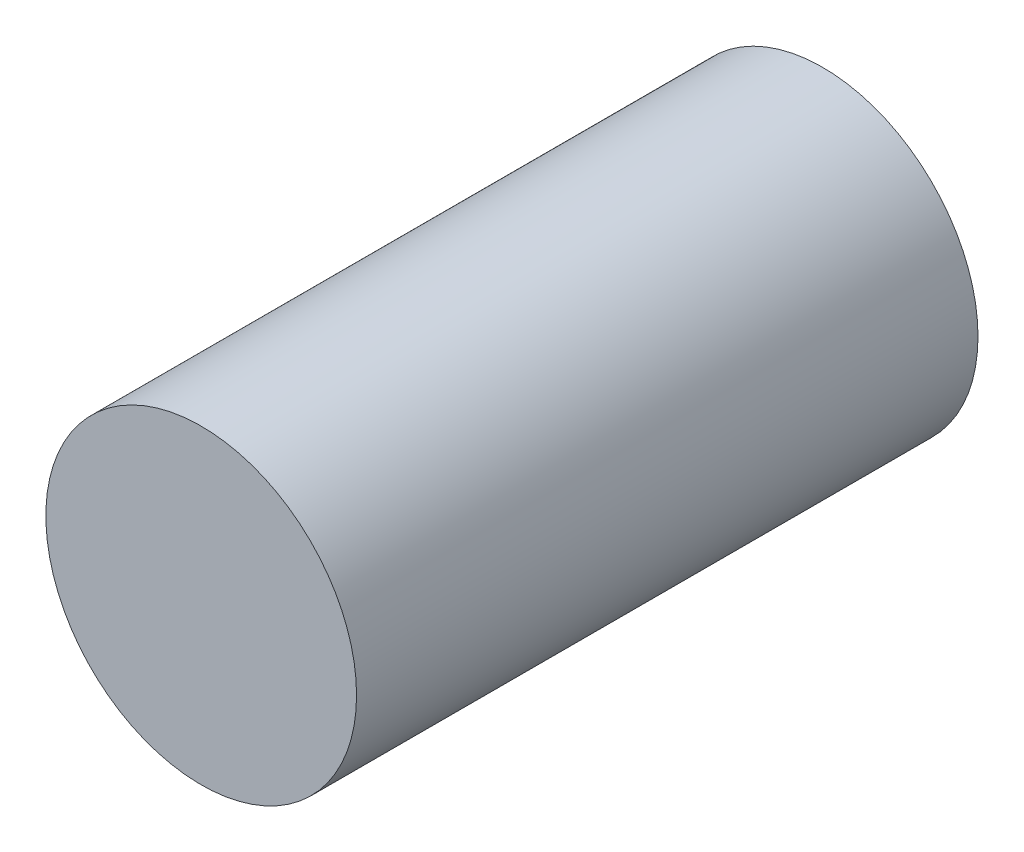
ISO-10303-21;
HEADER;
FILE_DESCRIPTION(('STEP AP214'),'2;1');
FILE_NAME('part.step','',(''),(''),'','','');
FILE_SCHEMA(('AUTOMOTIVE_DESIGN { 1 0 10303 214 1 1 1 1 }'));
ENDSEC;
DATA;
#1=APPLICATION_CONTEXT('core data for automotive mechanical design processes');
#2=APPLICATION_PROTOCOL_DEFINITION('international standard','automotive_design',2000,#1);
#3=PRODUCT_CONTEXT('',#1,'mechanical');
#4=PRODUCT('Part','Part','',(#3));
#5=PRODUCT_RELATED_PRODUCT_CATEGORY('part','',(#4));
#6=PRODUCT_DEFINITION_FORMATION('','',#4);
#7=PRODUCT_DEFINITION_CONTEXT('part definition',#1,'design');
#8=PRODUCT_DEFINITION('design','',#6,#7);
#9=PRODUCT_DEFINITION_SHAPE('','',#8);
#10=(LENGTH_UNIT() NAMED_UNIT(*) SI_UNIT(.MILLI.,.METRE.));
#11=(NAMED_UNIT(*) PLANE_ANGLE_UNIT() SI_UNIT($,.RADIAN.));
#12=(NAMED_UNIT(*) SI_UNIT($,.STERADIAN.) SOLID_ANGLE_UNIT());
#13=UNCERTAINTY_MEASURE_WITH_UNIT(LENGTH_MEASURE(1.E-05),#10,'distance_accuracy_value','');
#14=(GEOMETRIC_REPRESENTATION_CONTEXT(3) GLOBAL_UNCERTAINTY_ASSIGNED_CONTEXT((#13)) GLOBAL_UNIT_ASSIGNED_CONTEXT((#10,
#11,#12)) REPRESENTATION_CONTEXT('',''));
#15=CARTESIAN_POINT('',(0.,0.,0.));
#16=DIRECTION('',(0.,0.,1.));
#17=DIRECTION('',(1.,0.,0.));
#18=AXIS2_PLACEMENT_3D('',#15,#16,#17);
#19=CARTESIAN_POINT('',(0.,0.,40.));
#20=DIRECTION('',(0.,0.,-1.));
#21=DIRECTION('',(-1.,0.,0.));
#22=AXIS2_PLACEMENT_3D('',#19,#20,#21);
#23=CYLINDRICAL_SURFACE('',#22,10.);
#24=CARTESIAN_POINT('',(0.,0.,40.));
#25=DIRECTION('',(0.,0.,1.));
#26=DIRECTION('',(1.,0.,0.));
#27=AXIS2_PLACEMENT_3D('',#24,#25,#26);
#28=CIRCLE('',#27,10.);
#29=CARTESIAN_POINT('',(10.,0.,40.));
#30=VERTEX_POINT('',#29);
#31=EDGE_CURVE('E10',#30,#30,#28,.T.);
#32=ORIENTED_EDGE('',*,*,#31,.F.);
#33=EDGE_LOOP('',(#32));
#34=FACE_BOUND('',#33,.T.);
#35=CARTESIAN_POINT('',(0.,0.,0.));
#36=DIRECTION('',(0.,0.,1.));
#37=DIRECTION('',(1.,0.,0.));
#38=AXIS2_PLACEMENT_3D('',#35,#36,#37);
#39=CIRCLE('',#38,10.);
#40=CARTESIAN_POINT('',(10.,0.,0.));
#41=VERTEX_POINT('',#40);
#42=EDGE_CURVE('E35',#41,#41,#39,.T.);
#43=ORIENTED_EDGE('',*,*,#42,.T.);
#44=EDGE_LOOP('',(#43));
#45=FACE_BOUND('',#44,.T.);
#46=ADVANCED_FACE('F29',(#34,#45),#23,.T.);
#47=CARTESIAN_POINT('',(0.,0.,40.));
#48=DIRECTION('',(0.,0.,1.));
#49=DIRECTION('',(1.,0.,0.));
#50=AXIS2_PLACEMENT_3D('',#47,#48,#49);
#51=PLANE('',#50);
#52=ORIENTED_EDGE('',*,*,#31,.T.);
#53=EDGE_LOOP('',(#52));
#54=FACE_BOUND('',#53,.T.);
#55=ADVANCED_FACE('F44',(#54),#51,.T.);
#56=CARTESIAN_POINT('',(0.,0.,0.));
#57=DIRECTION('',(0.,0.,1.));
#58=DIRECTION('',(1.,0.,0.));
#59=AXIS2_PLACEMENT_3D('',#56,#57,#58);
#60=PLANE('',#59);
#61=ORIENTED_EDGE('',*,*,#42,.F.);
#62=EDGE_LOOP('',(#61));
#63=FACE_BOUND('',#62,.T.);
#64=ADVANCED_FACE('F42',(#63),#60,.F.);
#65=CLOSED_SHELL('',(#46,#55,#64));
#66=MANIFOLD_SOLID_BREP('B2',#65);
#67=ADVANCED_BREP_SHAPE_REPRESENTATION('',(#18,#66),#14);
#68=SHAPE_DEFINITION_REPRESENTATION(#9,#67);
ENDSEC;
END-ISO-10303-21;
